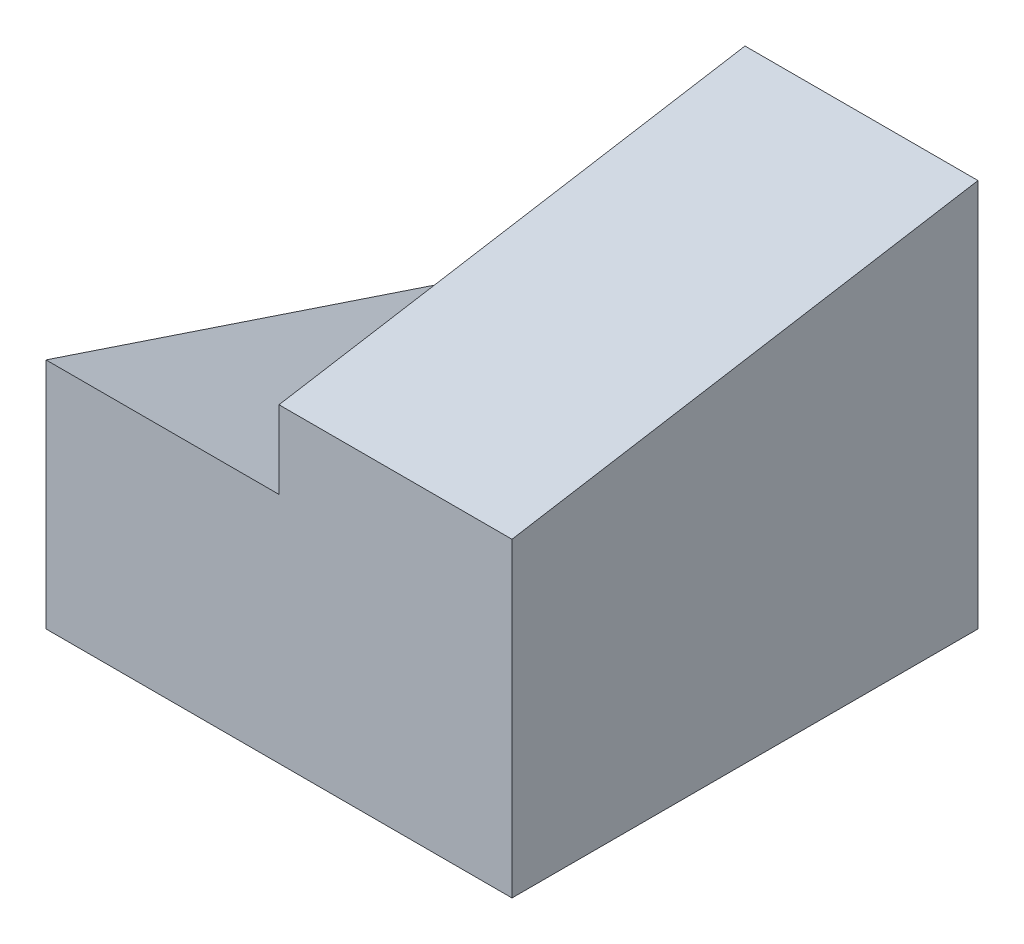
ISO-10303-21;
HEADER;
FILE_DESCRIPTION(('STEP AP214'),'2;1');
FILE_NAME('part.step','',(''),(''),'','','');
FILE_SCHEMA(('AUTOMOTIVE_DESIGN { 1 0 10303 214 1 1 1 1 }'));
ENDSEC;
DATA;
#1=APPLICATION_CONTEXT('core data for automotive mechanical design processes');
#2=APPLICATION_PROTOCOL_DEFINITION('international standard','automotive_design',2000,#1);
#3=PRODUCT_CONTEXT('',#1,'mechanical');
#4=PRODUCT('Part','Part','',(#3));
#5=PRODUCT_RELATED_PRODUCT_CATEGORY('part','',(#4));
#6=PRODUCT_DEFINITION_FORMATION('','',#4);
#7=PRODUCT_DEFINITION_CONTEXT('part definition',#1,'design');
#8=PRODUCT_DEFINITION('design','',#6,#7);
#9=PRODUCT_DEFINITION_SHAPE('','',#8);
#10=(LENGTH_UNIT() NAMED_UNIT(*) SI_UNIT(.MILLI.,.METRE.));
#11=(NAMED_UNIT(*) PLANE_ANGLE_UNIT() SI_UNIT($,.RADIAN.));
#12=(NAMED_UNIT(*) SI_UNIT($,.STERADIAN.) SOLID_ANGLE_UNIT());
#13=UNCERTAINTY_MEASURE_WITH_UNIT(LENGTH_MEASURE(1.E-05),#10,'distance_accuracy_value','');
#14=(GEOMETRIC_REPRESENTATION_CONTEXT(3) GLOBAL_UNCERTAINTY_ASSIGNED_CONTEXT((#13)) GLOBAL_UNIT_ASSIGNED_CONTEXT((#10,
#11,#12)) REPRESENTATION_CONTEXT('',''));
#15=CARTESIAN_POINT('',(0.,0.,0.));
#16=DIRECTION('',(0.,0.,1.));
#17=DIRECTION('',(1.,0.,0.));
#18=AXIS2_PLACEMENT_3D('',#15,#16,#17);
#19=CARTESIAN_POINT('',(0.,0.,6.));
#20=DIRECTION('',(1.,0.,0.));
#21=DIRECTION('',(0.,0.,-1.));
#22=AXIS2_PLACEMENT_3D('',#19,#20,#21);
#23=PLANE('',#22);
#24=DIRECTION('',(0.,-1.,0.));
#25=VECTOR('',#24,1.);
#26=CARTESIAN_POINT('',(0.,0.,6.));
#27=LINE('',#26,#25);
#28=CARTESIAN_POINT('',(0.,3.,6.));
#29=VERTEX_POINT('',#28);
#30=CARTESIAN_POINT('',(0.,0.,6.));
#31=VERTEX_POINT('',#30);
#32=EDGE_CURVE('E98',#29,#31,#27,.T.);
#33=ORIENTED_EDGE('',*,*,#32,.F.);
#34=DIRECTION('',(0.,0.316227766016838,0.948683298050514));
#35=VECTOR('',#34,1.);
#36=CARTESIAN_POINT('',(0.,3.,6.));
#37=LINE('',#36,#35);
#38=CARTESIAN_POINT('',(0.,1.,0.));
#39=VERTEX_POINT('',#38);
#40=EDGE_CURVE('E121',#39,#29,#37,.T.);
#41=ORIENTED_EDGE('',*,*,#40,.F.);
#42=DIRECTION('',(0.,-1.,0.));
#43=VECTOR('',#42,1.);
#44=CARTESIAN_POINT('',(0.,0.,0.));
#45=LINE('',#44,#43);
#46=CARTESIAN_POINT('',(0.,0.,0.));
#47=VERTEX_POINT('',#46);
#48=EDGE_CURVE('E106',#39,#47,#45,.T.);
#49=ORIENTED_EDGE('',*,*,#48,.T.);
#50=DIRECTION('',(0.,0.,-1.));
#51=VECTOR('',#50,1.);
#52=CARTESIAN_POINT('',(0.,0.,6.));
#53=LINE('',#52,#51);
#54=EDGE_CURVE('E11',#31,#47,#53,.T.);
#55=ORIENTED_EDGE('',*,*,#54,.F.);
#56=EDGE_LOOP('',(#33,#41,#49,#55));
#57=FACE_BOUND('',#56,.T.);
#58=ADVANCED_FACE('F33',(#57),#23,.F.);
#59=CARTESIAN_POINT('',(0.,0.,6.));
#60=DIRECTION('',(0.,1.,0.));
#61=DIRECTION('',(0.,0.,1.));
#62=AXIS2_PLACEMENT_3D('',#59,#60,#61);
#63=PLANE('',#62);
#64=DIRECTION('',(1.,0.,0.));
#65=VECTOR('',#64,1.);
#66=CARTESIAN_POINT('',(0.,0.,0.));
#67=LINE('',#66,#65);
#68=CARTESIAN_POINT('',(6.,0.,0.));
#69=VERTEX_POINT('',#68);
#70=EDGE_CURVE('E91',#47,#69,#67,.T.);
#71=ORIENTED_EDGE('',*,*,#70,.T.);
#72=DIRECTION('',(0.,0.,-1.));
#73=VECTOR('',#72,1.);
#74=CARTESIAN_POINT('',(6.,0.,6.));
#75=LINE('',#74,#73);
#76=CARTESIAN_POINT('',(6.,0.,6.));
#77=VERTEX_POINT('',#76);
#78=EDGE_CURVE('E40',#77,#69,#75,.T.);
#79=ORIENTED_EDGE('',*,*,#78,.F.);
#80=DIRECTION('',(1.,0.,0.));
#81=VECTOR('',#80,1.);
#82=CARTESIAN_POINT('',(0.,0.,6.));
#83=LINE('',#82,#81);
#84=EDGE_CURVE('E56',#31,#77,#83,.T.);
#85=ORIENTED_EDGE('',*,*,#84,.F.);
#86=ORIENTED_EDGE('',*,*,#54,.T.);
#87=EDGE_LOOP('',(#71,#79,#85,#86));
#88=FACE_BOUND('',#87,.T.);
#89=ADVANCED_FACE('F108',(#88),#63,.F.);
#90=CARTESIAN_POINT('',(6.,0.,6.));
#91=DIRECTION('',(-1.,0.,0.));
#92=DIRECTION('',(0.,0.,1.));
#93=AXIS2_PLACEMENT_3D('',#90,#91,#92);
#94=PLANE('',#93);
#95=DIRECTION('',(0.,1.,0.));
#96=VECTOR('',#95,1.);
#97=CARTESIAN_POINT('',(6.,0.,0.));
#98=LINE('',#97,#96);
#99=CARTESIAN_POINT('',(6.,5.,0.));
#100=VERTEX_POINT('',#99);
#101=EDGE_CURVE('E87',#69,#100,#98,.T.);
#102=ORIENTED_EDGE('',*,*,#101,.T.);
#103=DIRECTION('',(0.,-0.164398987305357,0.986393923832144));
#104=VECTOR('',#103,1.);
#105=CARTESIAN_POINT('',(6.,5.,0.));
#106=LINE('',#105,#104);
#107=CARTESIAN_POINT('',(6.,4.,6.));
#108=VERTEX_POINT('',#107);
#109=EDGE_CURVE('E73',#100,#108,#106,.T.);
#110=ORIENTED_EDGE('',*,*,#109,.T.);
#111=DIRECTION('',(0.,1.,0.));
#112=VECTOR('',#111,1.);
#113=CARTESIAN_POINT('',(6.,0.,6.));
#114=LINE('',#113,#112);
#115=EDGE_CURVE('E102',#77,#108,#114,.T.);
#116=ORIENTED_EDGE('',*,*,#115,.F.);
#117=ORIENTED_EDGE('',*,*,#78,.T.);
#118=EDGE_LOOP('',(#102,#110,#116,#117));
#119=FACE_BOUND('',#118,.T.);
#120=ADVANCED_FACE('F88',(#119),#94,.F.);
#121=CARTESIAN_POINT('',(0.,0.,6.));
#122=DIRECTION('',(0.,0.,-1.));
#123=DIRECTION('',(-1.,0.,0.));
#124=AXIS2_PLACEMENT_3D('',#121,#122,#123);
#125=PLANE('',#124);
#126=DIRECTION('',(0.,1.,0.));
#127=VECTOR('',#126,1.);
#128=CARTESIAN_POINT('',(3.,4.,6.));
#129=LINE('',#128,#127);
#130=CARTESIAN_POINT('',(3.,3.,6.));
#131=VERTEX_POINT('',#130);
#132=CARTESIAN_POINT('',(3.,4.,6.));
#133=VERTEX_POINT('',#132);
#134=EDGE_CURVE('E47',#131,#133,#129,.T.);
#135=ORIENTED_EDGE('',*,*,#134,.F.);
#136=DIRECTION('',(-1.,0.,0.));
#137=VECTOR('',#136,1.);
#138=CARTESIAN_POINT('',(3.,3.,6.));
#139=LINE('',#138,#137);
#140=EDGE_CURVE('E83',#131,#29,#139,.T.);
#141=ORIENTED_EDGE('',*,*,#140,.T.);
#142=ORIENTED_EDGE('',*,*,#32,.T.);
#143=ORIENTED_EDGE('',*,*,#84,.T.);
#144=ORIENTED_EDGE('',*,*,#115,.T.);
#145=DIRECTION('',(-1.,0.,0.));
#146=VECTOR('',#145,1.);
#147=CARTESIAN_POINT('',(6.,4.,6.));
#148=LINE('',#147,#146);
#149=EDGE_CURVE('E80',#108,#133,#148,.T.);
#150=ORIENTED_EDGE('',*,*,#149,.T.);
#151=EDGE_LOOP('',(#135,#141,#142,#143,#144,#150));
#152=FACE_BOUND('',#151,.T.);
#153=ADVANCED_FACE('F134',(#152),#125,.F.);
#154=CARTESIAN_POINT('',(0.,0.,0.));
#155=DIRECTION('',(0.,0.,-1.));
#156=DIRECTION('',(-1.,0.,0.));
#157=AXIS2_PLACEMENT_3D('',#154,#155,#156);
#158=PLANE('',#157);
#159=DIRECTION('',(-1.,0.,0.));
#160=VECTOR('',#159,1.);
#161=CARTESIAN_POINT('',(3.,1.,0.));
#162=LINE('',#161,#160);
#163=CARTESIAN_POINT('',(3.,1.,0.));
#164=VERTEX_POINT('',#163);
#165=EDGE_CURVE('E114',#164,#39,#162,.T.);
#166=ORIENTED_EDGE('',*,*,#165,.F.);
#167=DIRECTION('',(0.,-1.,0.));
#168=VECTOR('',#167,1.);
#169=CARTESIAN_POINT('',(3.,1.,0.));
#170=LINE('',#169,#168);
#171=CARTESIAN_POINT('',(3.,5.,0.));
#172=VERTEX_POINT('',#171);
#173=EDGE_CURVE('E97',#172,#164,#170,.T.);
#174=ORIENTED_EDGE('',*,*,#173,.F.);
#175=DIRECTION('',(-1.,0.,0.));
#176=VECTOR('',#175,1.);
#177=CARTESIAN_POINT('',(0.,5.,0.));
#178=LINE('',#177,#176);
#179=EDGE_CURVE('E78',#100,#172,#178,.T.);
#180=ORIENTED_EDGE('',*,*,#179,.F.);
#181=ORIENTED_EDGE('',*,*,#101,.F.);
#182=ORIENTED_EDGE('',*,*,#70,.F.);
#183=ORIENTED_EDGE('',*,*,#48,.F.);
#184=EDGE_LOOP('',(#166,#174,#180,#181,#182,#183));
#185=FACE_BOUND('',#184,.T.);
#186=ADVANCED_FACE('F95',(#185),#158,.T.);
#187=CARTESIAN_POINT('',(6.,5.,0.));
#188=DIRECTION('',(0.,-0.986393923832144,-0.164398987305357));
#189=DIRECTION('',(0.,0.164398987305357,-0.986393923832144));
#190=AXIS2_PLACEMENT_3D('',#187,#188,#189);
#191=PLANE('',#190);
#192=ORIENTED_EDGE('',*,*,#179,.T.);
#193=DIRECTION('',(0.,0.164398987305357,-0.986393923832144));
#194=VECTOR('',#193,1.);
#195=CARTESIAN_POINT('',(3.,5.,0.));
#196=LINE('',#195,#194);
#197=EDGE_CURVE('E130',#133,#172,#196,.T.);
#198=ORIENTED_EDGE('',*,*,#197,.F.);
#199=ORIENTED_EDGE('',*,*,#149,.F.);
#200=ORIENTED_EDGE('',*,*,#109,.F.);
#201=EDGE_LOOP('',(#192,#198,#199,#200));
#202=FACE_BOUND('',#201,.T.);
#203=ADVANCED_FACE('F75',(#202),#191,.F.);
#204=CARTESIAN_POINT('',(3.,3.,6.));
#205=DIRECTION('',(0.,-0.948683298050514,0.316227766016838));
#206=DIRECTION('',(0.,-0.316227766016838,-0.948683298050514));
#207=AXIS2_PLACEMENT_3D('',#204,#205,#206);
#208=PLANE('',#207);
#209=ORIENTED_EDGE('',*,*,#40,.T.);
#210=ORIENTED_EDGE('',*,*,#140,.F.);
#211=DIRECTION('',(0.,0.316227766016838,0.948683298050514));
#212=VECTOR('',#211,1.);
#213=CARTESIAN_POINT('',(3.,3.,6.));
#214=LINE('',#213,#212);
#215=EDGE_CURVE('E126',#164,#131,#214,.T.);
#216=ORIENTED_EDGE('',*,*,#215,.F.);
#217=ORIENTED_EDGE('',*,*,#165,.T.);
#218=EDGE_LOOP('',(#209,#210,#216,#217));
#219=FACE_BOUND('',#218,.T.);
#220=ADVANCED_FACE('F140',(#219),#208,.F.);
#221=CARTESIAN_POINT('',(3.,0.,0.));
#222=DIRECTION('',(1.,0.,0.));
#223=DIRECTION('',(0.,0.,-1.));
#224=AXIS2_PLACEMENT_3D('',#221,#222,#223);
#225=PLANE('',#224);
#226=ORIENTED_EDGE('',*,*,#173,.T.);
#227=ORIENTED_EDGE('',*,*,#215,.T.);
#228=ORIENTED_EDGE('',*,*,#134,.T.);
#229=ORIENTED_EDGE('',*,*,#197,.T.);
#230=EDGE_LOOP('',(#226,#227,#228,#229));
#231=FACE_BOUND('',#230,.T.);
#232=ADVANCED_FACE('F139',(#231),#225,.F.);
#233=CLOSED_SHELL('',(#58,#89,#120,#153,#186,#203,#220,#232));
#234=MANIFOLD_SOLID_BREP('B2',#233);
#235=ADVANCED_BREP_SHAPE_REPRESENTATION('',(#18,#234),#14);
#236=SHAPE_DEFINITION_REPRESENTATION(#9,#235);
ENDSEC;
END-ISO-10303-21;
